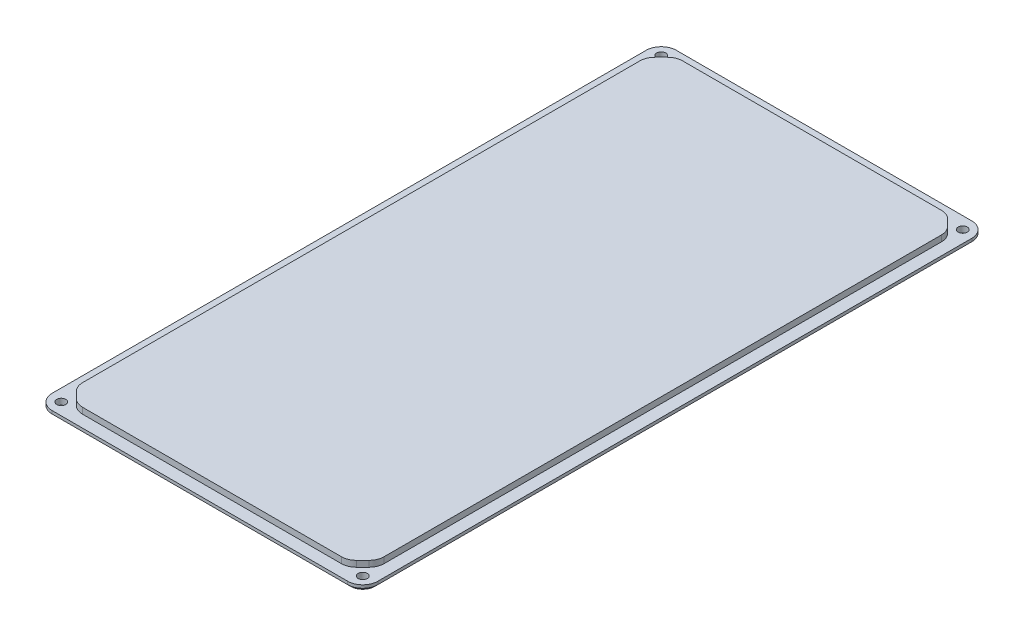
ISO-10303-21;
HEADER;
FILE_DESCRIPTION(('STEP AP214'),'2;1');
FILE_NAME('part.step','',(''),(''),'','','');
FILE_SCHEMA(('AUTOMOTIVE_DESIGN { 1 0 10303 214 1 1 1 1 }'));
ENDSEC;
DATA;
#1=APPLICATION_CONTEXT('core data for automotive mechanical design processes');
#2=APPLICATION_PROTOCOL_DEFINITION('international standard','automotive_design',2000,#1);
#3=PRODUCT_CONTEXT('',#1,'mechanical');
#4=PRODUCT('Part','Part','',(#3));
#5=PRODUCT_RELATED_PRODUCT_CATEGORY('part','',(#4));
#6=PRODUCT_DEFINITION_FORMATION('','',#4);
#7=PRODUCT_DEFINITION_CONTEXT('part definition',#1,'design');
#8=PRODUCT_DEFINITION('design','',#6,#7);
#9=PRODUCT_DEFINITION_SHAPE('','',#8);
#10=(LENGTH_UNIT() NAMED_UNIT(*) SI_UNIT(.MILLI.,.METRE.));
#11=(NAMED_UNIT(*) PLANE_ANGLE_UNIT() SI_UNIT($,.RADIAN.));
#12=(NAMED_UNIT(*) SI_UNIT($,.STERADIAN.) SOLID_ANGLE_UNIT());
#13=UNCERTAINTY_MEASURE_WITH_UNIT(LENGTH_MEASURE(1.E-05),#10,'distance_accuracy_value','');
#14=(GEOMETRIC_REPRESENTATION_CONTEXT(3) GLOBAL_UNCERTAINTY_ASSIGNED_CONTEXT((#13)) GLOBAL_UNIT_ASSIGNED_CONTEXT((#10,
#11,#12)) REPRESENTATION_CONTEXT('',''));
#15=CARTESIAN_POINT('',(0.,0.,0.));
#16=DIRECTION('',(0.,0.,1.));
#17=DIRECTION('',(1.,0.,0.));
#18=AXIS2_PLACEMENT_3D('',#15,#16,#17);
#19=CARTESIAN_POINT('',(0.,2.,0.));
#20=DIRECTION('',(0.,1.,0.));
#21=DIRECTION('',(0.,0.,1.));
#22=AXIS2_PLACEMENT_3D('',#19,#20,#21);
#23=PLANE('',#22);
#24=CARTESIAN_POINT('',(50.,2.,-99.5));
#25=DIRECTION('',(0.,1.,0.));
#26=DIRECTION('',(0.,0.,1.));
#27=AXIS2_PLACEMENT_3D('',#24,#25,#26);
#28=CIRCLE('',#27,1.49999999999999);
#29=CARTESIAN_POINT('',(50.,2.,-98.));
#30=VERTEX_POINT('',#29);
#31=EDGE_CURVE('E397',#30,#30,#28,.T.);
#32=ORIENTED_EDGE('',*,*,#31,.F.);
#33=EDGE_LOOP('',(#32));
#34=FACE_BOUND('',#33,.T.);
#35=CARTESIAN_POINT('',(-50.,2.,-99.5));
#36=DIRECTION('',(0.,1.,0.));
#37=DIRECTION('',(0.,0.,1.));
#38=AXIS2_PLACEMENT_3D('',#35,#36,#37);
#39=CIRCLE('',#38,1.49999999999999);
#40=CARTESIAN_POINT('',(-50.,2.,-98.));
#41=VERTEX_POINT('',#40);
#42=EDGE_CURVE('E407',#41,#41,#39,.T.);
#43=ORIENTED_EDGE('',*,*,#42,.F.);
#44=EDGE_LOOP('',(#43));
#45=FACE_BOUND('',#44,.T.);
#46=CARTESIAN_POINT('',(-50.,2.,99.5));
#47=DIRECTION('',(0.,1.,0.));
#48=DIRECTION('',(0.,0.,1.));
#49=AXIS2_PLACEMENT_3D('',#46,#47,#48);
#50=CIRCLE('',#49,1.49999999999999);
#51=CARTESIAN_POINT('',(-50.,2.,101.));
#52=VERTEX_POINT('',#51);
#53=EDGE_CURVE('E413',#52,#52,#50,.T.);
#54=ORIENTED_EDGE('',*,*,#53,.F.);
#55=EDGE_LOOP('',(#54));
#56=FACE_BOUND('',#55,.T.);
#57=CARTESIAN_POINT('',(50.,2.,99.5));
#58=DIRECTION('',(0.,1.,0.));
#59=DIRECTION('',(0.,0.,1.));
#60=AXIS2_PLACEMENT_3D('',#57,#58,#59);
#61=CIRCLE('',#60,1.49999999999999);
#62=CARTESIAN_POINT('',(50.,2.,101.));
#63=VERTEX_POINT('',#62);
#64=EDGE_CURVE('E419',#63,#63,#61,.T.);
#65=ORIENTED_EDGE('',*,*,#64,.F.);
#66=EDGE_LOOP('',(#65));
#67=FACE_BOUND('',#66,.T.);
#68=DIRECTION('',(0.,0.,1.));
#69=VECTOR('',#68,1.);
#70=CARTESIAN_POINT('',(-54.,2.,-103.5));
#71=LINE('',#70,#69);
#72=CARTESIAN_POINT('',(-54.,2.,-98.5));
#73=VERTEX_POINT('',#72);
#74=CARTESIAN_POINT('',(-54.,2.,98.5));
#75=VERTEX_POINT('',#74);
#76=EDGE_CURVE('E227',#73,#75,#71,.T.);
#77=ORIENTED_EDGE('',*,*,#76,.T.);
#78=CARTESIAN_POINT('',(-49.,2.,98.5));
#79=DIRECTION('',(0.,1.,0.));
#80=DIRECTION('',(0.,0.,1.));
#81=AXIS2_PLACEMENT_3D('',#78,#79,#80);
#82=CIRCLE('',#81,5.);
#83=CARTESIAN_POINT('',(-49.,2.,103.5));
#84=VERTEX_POINT('',#83);
#85=EDGE_CURVE('E221',#75,#84,#82,.T.);
#86=ORIENTED_EDGE('',*,*,#85,.T.);
#87=DIRECTION('',(1.,0.,0.));
#88=VECTOR('',#87,1.);
#89=CARTESIAN_POINT('',(-54.,2.,103.5));
#90=LINE('',#89,#88);
#91=CARTESIAN_POINT('',(49.,2.,103.5));
#92=VERTEX_POINT('',#91);
#93=EDGE_CURVE('E224',#84,#92,#90,.T.);
#94=ORIENTED_EDGE('',*,*,#93,.T.);
#95=CARTESIAN_POINT('',(49.,2.,98.5));
#96=DIRECTION('',(0.,1.,0.));
#97=DIRECTION('',(0.,0.,1.));
#98=AXIS2_PLACEMENT_3D('',#95,#96,#97);
#99=CIRCLE('',#98,5.);
#100=CARTESIAN_POINT('',(54.,2.,98.5));
#101=VERTEX_POINT('',#100);
#102=EDGE_CURVE('E232',#92,#101,#99,.T.);
#103=ORIENTED_EDGE('',*,*,#102,.T.);
#104=DIRECTION('',(0.,0.,-1.));
#105=VECTOR('',#104,1.);
#106=CARTESIAN_POINT('',(54.,2.,-103.5));
#107=LINE('',#106,#105);
#108=CARTESIAN_POINT('',(54.,2.,-98.5));
#109=VERTEX_POINT('',#108);
#110=EDGE_CURVE('E436',#101,#109,#107,.T.);
#111=ORIENTED_EDGE('',*,*,#110,.T.);
#112=CARTESIAN_POINT('',(49.,2.,-98.5));
#113=DIRECTION('',(0.,1.,0.));
#114=DIRECTION('',(0.,0.,1.));
#115=AXIS2_PLACEMENT_3D('',#112,#113,#114);
#116=CIRCLE('',#115,5.);
#117=CARTESIAN_POINT('',(49.,2.,-103.5));
#118=VERTEX_POINT('',#117);
#119=EDGE_CURVE('E259',#109,#118,#116,.T.);
#120=ORIENTED_EDGE('',*,*,#119,.T.);
#121=DIRECTION('',(-1.,0.,0.));
#122=VECTOR('',#121,1.);
#123=CARTESIAN_POINT('',(-54.,2.,-103.5));
#124=LINE('',#123,#122);
#125=CARTESIAN_POINT('',(-49.,2.,-103.5));
#126=VERTEX_POINT('',#125);
#127=EDGE_CURVE('E449',#118,#126,#124,.T.);
#128=ORIENTED_EDGE('',*,*,#127,.T.);
#129=CARTESIAN_POINT('',(-49.,2.,-98.5));
#130=DIRECTION('',(0.,1.,0.));
#131=DIRECTION('',(0.,0.,1.));
#132=AXIS2_PLACEMENT_3D('',#129,#130,#131);
#133=CIRCLE('',#132,5.);
#134=EDGE_CURVE('E257',#126,#73,#133,.T.);
#135=ORIENTED_EDGE('',*,*,#134,.T.);
#136=EDGE_LOOP('',(#77,#86,#94,#103,#111,#120,#128,#135));
#137=FACE_BOUND('',#136,.T.);
#138=DIRECTION('',(-1.,0.,0.));
#139=VECTOR('',#138,1.);
#140=CARTESIAN_POINT('',(-50.,2.,-99.5));
#141=LINE('',#140,#139);
#142=CARTESIAN_POINT('',(42.9289321881345,2.,-99.5));
#143=VERTEX_POINT('',#142);
#144=CARTESIAN_POINT('',(-42.9289321881345,2.,-99.5));
#145=VERTEX_POINT('',#144);
#146=EDGE_CURVE('E439',#143,#145,#141,.T.);
#147=ORIENTED_EDGE('',*,*,#146,.F.);
#148=CARTESIAN_POINT('',(42.9289321881345,2.,-94.5));
#149=DIRECTION('',(0.,1.,0.));
#150=DIRECTION('',(0.,0.,1.));
#151=AXIS2_PLACEMENT_3D('',#148,#149,#150);
#152=CIRCLE('',#151,5.);
#153=CARTESIAN_POINT('',(46.4644660940673,2.,-98.0355339059327));
#154=VERTEX_POINT('',#153);
#155=EDGE_CURVE('E334',#143,#154,#152,.F.);
#156=ORIENTED_EDGE('',*,*,#155,.T.);
#157=DIRECTION('',(-0.707106781186546,0.,-0.707106781186549));
#158=VECTOR('',#157,1.);
#159=CARTESIAN_POINT('',(45.,2.,-99.5));
#160=LINE('',#159,#158);
#161=CARTESIAN_POINT('',(48.5355339059327,2.,-95.9644660940672));
#162=VERTEX_POINT('',#161);
#163=EDGE_CURVE('E467',#154,#162,#160,.F.);
#164=ORIENTED_EDGE('',*,*,#163,.T.);
#165=CARTESIAN_POINT('',(45.,2.,-92.4289321881345));
#166=DIRECTION('',(0.,1.,0.));
#167=DIRECTION('',(0.,0.,1.));
#168=AXIS2_PLACEMENT_3D('',#165,#166,#167);
#169=CIRCLE('',#168,5.);
#170=CARTESIAN_POINT('',(50.,2.,-92.4289321881345));
#171=VERTEX_POINT('',#170);
#172=EDGE_CURVE('E336',#162,#171,#169,.F.);
#173=ORIENTED_EDGE('',*,*,#172,.T.);
#174=DIRECTION('',(0.,0.,-1.));
#175=VECTOR('',#174,1.);
#176=CARTESIAN_POINT('',(50.,2.,-99.5));
#177=LINE('',#176,#175);
#178=CARTESIAN_POINT('',(50.,2.,92.4289321881346));
#179=VERTEX_POINT('',#178);
#180=EDGE_CURVE('E422',#179,#171,#177,.T.);
#181=ORIENTED_EDGE('',*,*,#180,.F.);
#182=CARTESIAN_POINT('',(45.,2.,92.4289321881346));
#183=DIRECTION('',(0.,1.,0.));
#184=DIRECTION('',(0.,0.,1.));
#185=AXIS2_PLACEMENT_3D('',#182,#183,#184);
#186=CIRCLE('',#185,5.);
#187=CARTESIAN_POINT('',(48.5355339059327,2.,95.9644660940673));
#188=VERTEX_POINT('',#187);
#189=EDGE_CURVE('E330',#179,#188,#186,.F.);
#190=ORIENTED_EDGE('',*,*,#189,.T.);
#191=DIRECTION('',(0.70710678118655,0.,-0.707106781186545));
#192=VECTOR('',#191,1.);
#193=CARTESIAN_POINT('',(50.,2.,94.5));
#194=LINE('',#193,#192);
#195=CARTESIAN_POINT('',(46.4644660940673,2.,98.0355339059328));
#196=VERTEX_POINT('',#195);
#197=EDGE_CURVE('E252',#188,#196,#194,.F.);
#198=ORIENTED_EDGE('',*,*,#197,.T.);
#199=CARTESIAN_POINT('',(42.9289321881345,2.,94.5));
#200=DIRECTION('',(0.,1.,0.));
#201=DIRECTION('',(0.,0.,1.));
#202=AXIS2_PLACEMENT_3D('',#199,#200,#201);
#203=CIRCLE('',#202,5.);
#204=CARTESIAN_POINT('',(42.9289321881345,2.,99.5));
#205=VERTEX_POINT('',#204);
#206=EDGE_CURVE('E332',#196,#205,#203,.F.);
#207=ORIENTED_EDGE('',*,*,#206,.T.);
#208=DIRECTION('',(1.,0.,0.));
#209=VECTOR('',#208,1.);
#210=CARTESIAN_POINT('',(-50.,2.,99.5));
#211=LINE('',#210,#209);
#212=CARTESIAN_POINT('',(-42.9289321881345,2.,99.5));
#213=VERTEX_POINT('',#212);
#214=EDGE_CURVE('E427',#213,#205,#211,.T.);
#215=ORIENTED_EDGE('',*,*,#214,.F.);
#216=CARTESIAN_POINT('',(-42.9289321881345,2.,94.5));
#217=DIRECTION('',(0.,1.,0.));
#218=DIRECTION('',(0.,0.,1.));
#219=AXIS2_PLACEMENT_3D('',#216,#217,#218);
#220=CIRCLE('',#219,5.);
#221=CARTESIAN_POINT('',(-46.4644660940673,2.,98.0355339059327));
#222=VERTEX_POINT('',#221);
#223=EDGE_CURVE('E328',#213,#222,#220,.F.);
#224=ORIENTED_EDGE('',*,*,#223,.T.);
#225=DIRECTION('',(0.707106781186546,0.,0.707106781186549));
#226=VECTOR('',#225,1.);
#227=CARTESIAN_POINT('',(-45.,2.,99.5));
#228=LINE('',#227,#226);
#229=CARTESIAN_POINT('',(-48.5355339059327,2.,95.9644660940673));
#230=VERTEX_POINT('',#229);
#231=EDGE_CURVE('E470',#222,#230,#228,.F.);
#232=ORIENTED_EDGE('',*,*,#231,.T.);
#233=CARTESIAN_POINT('',(-45.,2.,92.4289321881345));
#234=DIRECTION('',(0.,1.,0.));
#235=DIRECTION('',(0.,0.,1.));
#236=AXIS2_PLACEMENT_3D('',#233,#234,#235);
#237=CIRCLE('',#236,5.);
#238=CARTESIAN_POINT('',(-50.,2.,92.4289321881345));
#239=VERTEX_POINT('',#238);
#240=EDGE_CURVE('E326',#230,#239,#237,.F.);
#241=ORIENTED_EDGE('',*,*,#240,.T.);
#242=DIRECTION('',(0.,0.,1.));
#243=VECTOR('',#242,1.);
#244=CARTESIAN_POINT('',(-50.,2.,-99.5));
#245=LINE('',#244,#243);
#246=CARTESIAN_POINT('',(-50.,2.,-92.4289321881345));
#247=VERTEX_POINT('',#246);
#248=EDGE_CURVE('E442',#247,#239,#245,.T.);
#249=ORIENTED_EDGE('',*,*,#248,.F.);
#250=CARTESIAN_POINT('',(-45.,2.,-92.4289321881345));
#251=DIRECTION('',(0.,1.,0.));
#252=DIRECTION('',(0.,0.,1.));
#253=AXIS2_PLACEMENT_3D('',#250,#251,#252);
#254=CIRCLE('',#253,5.);
#255=CARTESIAN_POINT('',(-48.5355339059327,2.,-95.9644660940673));
#256=VERTEX_POINT('',#255);
#257=EDGE_CURVE('E340',#247,#256,#254,.F.);
#258=ORIENTED_EDGE('',*,*,#257,.T.);
#259=DIRECTION('',(-0.707106781186549,0.,0.707106781186546));
#260=VECTOR('',#259,1.);
#261=CARTESIAN_POINT('',(-50.,2.,-94.5));
#262=LINE('',#261,#260);
#263=CARTESIAN_POINT('',(-46.4644660940673,2.,-98.0355339059327));
#264=VERTEX_POINT('',#263);
#265=EDGE_CURVE('E464',#256,#264,#262,.F.);
#266=ORIENTED_EDGE('',*,*,#265,.T.);
#267=CARTESIAN_POINT('',(-42.9289321881345,2.,-94.5));
#268=DIRECTION('',(0.,1.,0.));
#269=DIRECTION('',(0.,0.,1.));
#270=AXIS2_PLACEMENT_3D('',#267,#268,#269);
#271=CIRCLE('',#270,5.);
#272=EDGE_CURVE('E338',#264,#145,#271,.F.);
#273=ORIENTED_EDGE('',*,*,#272,.T.);
#274=EDGE_LOOP('',(#147,#156,#164,#173,#181,#190,#198,#207,#215,#224,#232,#241,#249,#258,#266,#273));
#275=FACE_BOUND('',#274,.T.);
#276=ADVANCED_FACE('F33',(#34,#45,#56,#67,#137,#275),#23,.T.);
#277=CARTESIAN_POINT('',(54.,2.,-103.5));
#278=DIRECTION('',(-1.,0.,0.));
#279=DIRECTION('',(0.,0.,1.));
#280=AXIS2_PLACEMENT_3D('',#277,#278,#279);
#281=PLANE('',#280);
#282=DIRECTION('',(0.,-1.,0.));
#283=VECTOR('',#282,1.);
#284=CARTESIAN_POINT('',(54.,2.,98.5));
#285=LINE('',#284,#283);
#286=CARTESIAN_POINT('',(54.,0.999999999999973,98.5));
#287=VERTEX_POINT('',#286);
#288=EDGE_CURVE('E295',#101,#287,#285,.T.);
#289=ORIENTED_EDGE('',*,*,#288,.T.);
#290=DIRECTION('',(0.,0.,-1.));
#291=VECTOR('',#290,1.);
#292=CARTESIAN_POINT('',(54.,0.999999999999973,-103.5));
#293=LINE('',#292,#291);
#294=CARTESIAN_POINT('',(54.,0.999999999999973,-98.5));
#295=VERTEX_POINT('',#294);
#296=EDGE_CURVE('E364',#287,#295,#293,.T.);
#297=ORIENTED_EDGE('',*,*,#296,.T.);
#298=DIRECTION('',(0.,-1.,0.));
#299=VECTOR('',#298,1.);
#300=CARTESIAN_POINT('',(54.,2.,-98.5));
#301=LINE('',#300,#299);
#302=EDGE_CURVE('E293',#295,#109,#301,.F.);
#303=ORIENTED_EDGE('',*,*,#302,.T.);
#304=ORIENTED_EDGE('',*,*,#110,.F.);
#305=EDGE_LOOP('',(#289,#297,#303,#304));
#306=FACE_BOUND('',#305,.T.);
#307=ADVANCED_FACE('F556',(#306),#281,.F.);
#308=CARTESIAN_POINT('',(-54.,2.,-103.5));
#309=DIRECTION('',(0.,0.,1.));
#310=DIRECTION('',(1.,0.,0.));
#311=AXIS2_PLACEMENT_3D('',#308,#309,#310);
#312=PLANE('',#311);
#313=DIRECTION('',(0.,-1.,0.));
#314=VECTOR('',#313,1.);
#315=CARTESIAN_POINT('',(49.,2.,-103.5));
#316=LINE('',#315,#314);
#317=CARTESIAN_POINT('',(49.,0.999999999999973,-103.5));
#318=VERTEX_POINT('',#317);
#319=EDGE_CURVE('E310',#118,#318,#316,.T.);
#320=ORIENTED_EDGE('',*,*,#319,.T.);
#321=DIRECTION('',(-1.,0.,0.));
#322=VECTOR('',#321,1.);
#323=CARTESIAN_POINT('',(-54.,0.999999999999973,-103.5));
#324=LINE('',#323,#322);
#325=CARTESIAN_POINT('',(-49.,0.999999999999973,-103.5));
#326=VERTEX_POINT('',#325);
#327=EDGE_CURVE('E11',#318,#326,#324,.T.);
#328=ORIENTED_EDGE('',*,*,#327,.T.);
#329=DIRECTION('',(0.,-1.,0.));
#330=VECTOR('',#329,1.);
#331=CARTESIAN_POINT('',(-49.,2.,-103.5));
#332=LINE('',#331,#330);
#333=EDGE_CURVE('E308',#326,#126,#332,.F.);
#334=ORIENTED_EDGE('',*,*,#333,.T.);
#335=ORIENTED_EDGE('',*,*,#127,.F.);
#336=EDGE_LOOP('',(#320,#328,#334,#335));
#337=FACE_BOUND('',#336,.T.);
#338=ADVANCED_FACE('F562',(#337),#312,.F.);
#339=CARTESIAN_POINT('',(-54.,2.,-103.5));
#340=DIRECTION('',(1.,0.,0.));
#341=DIRECTION('',(0.,0.,-1.));
#342=AXIS2_PLACEMENT_3D('',#339,#340,#341);
#343=PLANE('',#342);
#344=DIRECTION('',(0.,-1.,0.));
#345=VECTOR('',#344,1.);
#346=CARTESIAN_POINT('',(-54.,2.,-98.5));
#347=LINE('',#346,#345);
#348=CARTESIAN_POINT('',(-54.,0.999999999999973,-98.5));
#349=VERTEX_POINT('',#348);
#350=EDGE_CURVE('E247',#73,#349,#347,.T.);
#351=ORIENTED_EDGE('',*,*,#350,.T.);
#352=DIRECTION('',(0.,0.,1.));
#353=VECTOR('',#352,1.);
#354=CARTESIAN_POINT('',(-54.,0.999999999999973,-103.5));
#355=LINE('',#354,#353);
#356=CARTESIAN_POINT('',(-54.,0.999999999999973,98.5));
#357=VERTEX_POINT('',#356);
#358=EDGE_CURVE('E366',#349,#357,#355,.T.);
#359=ORIENTED_EDGE('',*,*,#358,.T.);
#360=DIRECTION('',(0.,-1.,0.));
#361=VECTOR('',#360,1.);
#362=CARTESIAN_POINT('',(-54.,2.,98.5));
#363=LINE('',#362,#361);
#364=EDGE_CURVE('E250',#357,#75,#363,.F.);
#365=ORIENTED_EDGE('',*,*,#364,.T.);
#366=ORIENTED_EDGE('',*,*,#76,.F.);
#367=EDGE_LOOP('',(#351,#359,#365,#366));
#368=FACE_BOUND('',#367,.T.);
#369=ADVANCED_FACE('F576',(#368),#343,.F.);
#370=CARTESIAN_POINT('',(-54.,2.,103.5));
#371=DIRECTION('',(0.,0.,-1.));
#372=DIRECTION('',(-1.,0.,0.));
#373=AXIS2_PLACEMENT_3D('',#370,#371,#372);
#374=PLANE('',#373);
#375=DIRECTION('',(0.,-1.,0.));
#376=VECTOR('',#375,1.);
#377=CARTESIAN_POINT('',(-49.,2.,103.5));
#378=LINE('',#377,#376);
#379=CARTESIAN_POINT('',(-49.,0.999999999999973,103.5));
#380=VERTEX_POINT('',#379);
#381=EDGE_CURVE('E238',#84,#380,#378,.T.);
#382=ORIENTED_EDGE('',*,*,#381,.T.);
#383=DIRECTION('',(1.,0.,0.));
#384=VECTOR('',#383,1.);
#385=CARTESIAN_POINT('',(-54.,0.999999999999973,103.5));
#386=LINE('',#385,#384);
#387=CARTESIAN_POINT('',(49.,0.999999999999973,103.5));
#388=VERTEX_POINT('',#387);
#389=EDGE_CURVE('E342',#380,#388,#386,.T.);
#390=ORIENTED_EDGE('',*,*,#389,.T.);
#391=DIRECTION('',(0.,-1.,0.));
#392=VECTOR('',#391,1.);
#393=CARTESIAN_POINT('',(49.,2.,103.5));
#394=LINE('',#393,#392);
#395=EDGE_CURVE('E241',#388,#92,#394,.F.);
#396=ORIENTED_EDGE('',*,*,#395,.T.);
#397=ORIENTED_EDGE('',*,*,#93,.F.);
#398=EDGE_LOOP('',(#382,#390,#396,#397));
#399=FACE_BOUND('',#398,.T.);
#400=ADVANCED_FACE('F236',(#399),#374,.F.);
#401=CARTESIAN_POINT('',(0.,0.,0.));
#402=DIRECTION('',(0.,1.,0.));
#403=DIRECTION('',(0.,0.,1.));
#404=AXIS2_PLACEMENT_3D('',#401,#402,#403);
#405=PLANE('',#404);
#406=CARTESIAN_POINT('',(49.,0.,98.5));
#407=DIRECTION('',(0.,1.,0.));
#408=DIRECTION('',(0.,0.,1.));
#409=AXIS2_PLACEMENT_3D('',#406,#407,#408);
#410=CIRCLE('',#409,4.00000000000003);
#411=CARTESIAN_POINT('',(53.,0.,98.5));
#412=VERTEX_POINT('',#411);
#413=CARTESIAN_POINT('',(49.,0.,102.5));
#414=VERTEX_POINT('',#413);
#415=EDGE_CURVE('E356',#412,#414,#410,.F.);
#416=ORIENTED_EDGE('',*,*,#415,.T.);
#417=DIRECTION('',(-1.,0.,0.));
#418=VECTOR('',#417,1.);
#419=CARTESIAN_POINT('',(0.,0.,102.5));
#420=LINE('',#419,#418);
#421=CARTESIAN_POINT('',(-49.,0.,102.5));
#422=VERTEX_POINT('',#421);
#423=EDGE_CURVE('E358',#414,#422,#420,.T.);
#424=ORIENTED_EDGE('',*,*,#423,.T.);
#425=CARTESIAN_POINT('',(-49.,0.,98.5));
#426=DIRECTION('',(0.,1.,0.));
#427=DIRECTION('',(0.,0.,1.));
#428=AXIS2_PLACEMENT_3D('',#425,#426,#427);
#429=CIRCLE('',#428,4.00000000000002);
#430=CARTESIAN_POINT('',(-53.,0.,98.5));
#431=VERTEX_POINT('',#430);
#432=EDGE_CURVE('E354',#422,#431,#429,.F.);
#433=ORIENTED_EDGE('',*,*,#432,.T.);
#434=DIRECTION('',(0.,0.,-1.));
#435=VECTOR('',#434,1.);
#436=CARTESIAN_POINT('',(-53.,0.,0.));
#437=LINE('',#436,#435);
#438=CARTESIAN_POINT('',(-53.,0.,-98.5));
#439=VERTEX_POINT('',#438);
#440=EDGE_CURVE('E350',#431,#439,#437,.T.);
#441=ORIENTED_EDGE('',*,*,#440,.T.);
#442=CARTESIAN_POINT('',(-49.,0.,-98.5));
#443=DIRECTION('',(0.,1.,0.));
#444=DIRECTION('',(0.,0.,1.));
#445=AXIS2_PLACEMENT_3D('',#442,#443,#444);
#446=CIRCLE('',#445,4.00000000000003);
#447=CARTESIAN_POINT('',(-49.,0.,-102.5));
#448=VERTEX_POINT('',#447);
#449=EDGE_CURVE('E346',#439,#448,#446,.F.);
#450=ORIENTED_EDGE('',*,*,#449,.T.);
#451=DIRECTION('',(1.,0.,0.));
#452=VECTOR('',#451,1.);
#453=CARTESIAN_POINT('',(0.,0.,-102.5));
#454=LINE('',#453,#452);
#455=CARTESIAN_POINT('',(49.,0.,-102.5));
#456=VERTEX_POINT('',#455);
#457=EDGE_CURVE('E344',#448,#456,#454,.T.);
#458=ORIENTED_EDGE('',*,*,#457,.T.);
#459=CARTESIAN_POINT('',(49.,0.,-98.5));
#460=DIRECTION('',(0.,1.,0.));
#461=DIRECTION('',(0.,0.,1.));
#462=AXIS2_PLACEMENT_3D('',#459,#460,#461);
#463=CIRCLE('',#462,4.00000000000002);
#464=CARTESIAN_POINT('',(53.,0.,-98.5));
#465=VERTEX_POINT('',#464);
#466=EDGE_CURVE('E348',#456,#465,#463,.F.);
#467=ORIENTED_EDGE('',*,*,#466,.T.);
#468=DIRECTION('',(0.,0.,1.));
#469=VECTOR('',#468,1.);
#470=CARTESIAN_POINT('',(53.,0.,0.));
#471=LINE('',#470,#469);
#472=EDGE_CURVE('E352',#465,#412,#471,.T.);
#473=ORIENTED_EDGE('',*,*,#472,.T.);
#474=EDGE_LOOP('',(#416,#424,#433,#441,#450,#458,#467,#473));
#475=FACE_BOUND('',#474,.T.);
#476=CARTESIAN_POINT('',(50.,0.,-99.5));
#477=DIRECTION('',(0.,-1.,0.));
#478=DIRECTION('',(0.,0.,-1.));
#479=AXIS2_PLACEMENT_3D('',#476,#477,#478);
#480=CIRCLE('',#479,1.49999999999999);
#481=CARTESIAN_POINT('',(50.,0.,-101.));
#482=VERTEX_POINT('',#481);
#483=EDGE_CURVE('E391',#482,#482,#480,.T.);
#484=ORIENTED_EDGE('',*,*,#483,.F.);
#485=EDGE_LOOP('',(#484));
#486=FACE_BOUND('',#485,.T.);
#487=CARTESIAN_POINT('',(-50.,0.,-99.5));
#488=DIRECTION('',(0.,-1.,0.));
#489=DIRECTION('',(0.,0.,-1.));
#490=AXIS2_PLACEMENT_3D('',#487,#488,#489);
#491=CIRCLE('',#490,1.49999999999999);
#492=CARTESIAN_POINT('',(-50.,0.,-101.));
#493=VERTEX_POINT('',#492);
#494=EDGE_CURVE('E402',#493,#493,#491,.T.);
#495=ORIENTED_EDGE('',*,*,#494,.F.);
#496=EDGE_LOOP('',(#495));
#497=FACE_BOUND('',#496,.T.);
#498=CARTESIAN_POINT('',(-50.,0.,99.5));
#499=DIRECTION('',(0.,-1.,0.));
#500=DIRECTION('',(0.,0.,-1.));
#501=AXIS2_PLACEMENT_3D('',#498,#499,#500);
#502=CIRCLE('',#501,1.49999999999999);
#503=CARTESIAN_POINT('',(-50.,0.,98.));
#504=VERTEX_POINT('',#503);
#505=EDGE_CURVE('E410',#504,#504,#502,.T.);
#506=ORIENTED_EDGE('',*,*,#505,.F.);
#507=EDGE_LOOP('',(#506));
#508=FACE_BOUND('',#507,.T.);
#509=CARTESIAN_POINT('',(50.,0.,99.5));
#510=DIRECTION('',(0.,-1.,0.));
#511=DIRECTION('',(0.,0.,-1.));
#512=AXIS2_PLACEMENT_3D('',#509,#510,#511);
#513=CIRCLE('',#512,1.49999999999999);
#514=CARTESIAN_POINT('',(50.,0.,98.));
#515=VERTEX_POINT('',#514);
#516=EDGE_CURVE('E416',#515,#515,#513,.T.);
#517=ORIENTED_EDGE('',*,*,#516,.F.);
#518=EDGE_LOOP('',(#517));
#519=FACE_BOUND('',#518,.T.);
#520=ADVANCED_FACE('F570',(#475,#486,#497,#508,#519),#405,.F.);
#521=CARTESIAN_POINT('',(50.,4.,-99.5));
#522=DIRECTION('',(-1.,0.,0.));
#523=DIRECTION('',(0.,0.,1.));
#524=AXIS2_PLACEMENT_3D('',#521,#522,#523);
#525=PLANE('',#524);
#526=DIRECTION('',(0.,0.,-1.));
#527=VECTOR('',#526,1.);
#528=CARTESIAN_POINT('',(50.,4.,-99.5));
#529=LINE('',#528,#527);
#530=CARTESIAN_POINT('',(50.,4.,92.4289321881346));
#531=VERTEX_POINT('',#530);
#532=CARTESIAN_POINT('',(50.,4.,-92.4289321881345));
#533=VERTEX_POINT('',#532);
#534=EDGE_CURVE('E423',#531,#533,#529,.T.);
#535=ORIENTED_EDGE('',*,*,#534,.F.);
#536=DIRECTION('',(0.,1.,0.));
#537=VECTOR('',#536,1.);
#538=CARTESIAN_POINT('',(50.,2.,92.4289321881346));
#539=LINE('',#538,#537);
#540=EDGE_CURVE('E301',#531,#179,#539,.F.);
#541=ORIENTED_EDGE('',*,*,#540,.T.);
#542=ORIENTED_EDGE('',*,*,#180,.T.);
#543=DIRECTION('',(0.,-1.,0.));
#544=VECTOR('',#543,1.);
#545=CARTESIAN_POINT('',(50.,4.,-92.4289321881345));
#546=LINE('',#545,#544);
#547=EDGE_CURVE('E298',#171,#533,#546,.F.);
#548=ORIENTED_EDGE('',*,*,#547,.T.);
#549=EDGE_LOOP('',(#535,#541,#542,#548));
#550=FACE_BOUND('',#549,.T.);
#551=ADVANCED_FACE('F541',(#550),#525,.F.);
#552=CARTESIAN_POINT('',(-50.,4.,-99.5));
#553=DIRECTION('',(0.,0.,1.));
#554=DIRECTION('',(1.,0.,0.));
#555=AXIS2_PLACEMENT_3D('',#552,#553,#554);
#556=PLANE('',#555);
#557=DIRECTION('',(-1.,0.,0.));
#558=VECTOR('',#557,1.);
#559=CARTESIAN_POINT('',(-50.,4.,-99.5));
#560=LINE('',#559,#558);
#561=CARTESIAN_POINT('',(42.9289321881345,4.,-99.5));
#562=VERTEX_POINT('',#561);
#563=CARTESIAN_POINT('',(-42.9289321881345,4.,-99.5));
#564=VERTEX_POINT('',#563);
#565=EDGE_CURVE('E426',#562,#564,#560,.T.);
#566=ORIENTED_EDGE('',*,*,#565,.F.);
#567=DIRECTION('',(0.,1.,0.));
#568=VECTOR('',#567,1.);
#569=CARTESIAN_POINT('',(42.9289321881345,2.,-99.5));
#570=LINE('',#569,#568);
#571=EDGE_CURVE('E315',#562,#143,#570,.F.);
#572=ORIENTED_EDGE('',*,*,#571,.T.);
#573=ORIENTED_EDGE('',*,*,#146,.T.);
#574=DIRECTION('',(0.,-1.,0.));
#575=VECTOR('',#574,1.);
#576=CARTESIAN_POINT('',(-42.9289321881345,4.,-99.5));
#577=LINE('',#576,#575);
#578=EDGE_CURVE('E312',#145,#564,#577,.F.);
#579=ORIENTED_EDGE('',*,*,#578,.T.);
#580=EDGE_LOOP('',(#566,#572,#573,#579));
#581=FACE_BOUND('',#580,.T.);
#582=ADVANCED_FACE('F524',(#581),#556,.F.);
#583=CARTESIAN_POINT('',(-50.,4.,-99.5));
#584=DIRECTION('',(1.,0.,0.));
#585=DIRECTION('',(0.,0.,-1.));
#586=AXIS2_PLACEMENT_3D('',#583,#584,#585);
#587=PLANE('',#586);
#588=ORIENTED_EDGE('',*,*,#248,.T.);
#589=DIRECTION('',(0.,-1.,0.));
#590=VECTOR('',#589,1.);
#591=CARTESIAN_POINT('',(-50.,4.,92.4289321881345));
#592=LINE('',#591,#590);
#593=CARTESIAN_POINT('',(-50.,4.,92.4289321881345));
#594=VERTEX_POINT('',#593);
#595=EDGE_CURVE('E264',#239,#594,#592,.F.);
#596=ORIENTED_EDGE('',*,*,#595,.T.);
#597=DIRECTION('',(0.,0.,1.));
#598=VECTOR('',#597,1.);
#599=CARTESIAN_POINT('',(-50.,4.,-99.5));
#600=LINE('',#599,#598);
#601=CARTESIAN_POINT('',(-50.,4.,-92.4289321881345));
#602=VERTEX_POINT('',#601);
#603=EDGE_CURVE('E430',#602,#594,#600,.T.);
#604=ORIENTED_EDGE('',*,*,#603,.F.);
#605=DIRECTION('',(0.,1.,0.));
#606=VECTOR('',#605,1.);
#607=CARTESIAN_POINT('',(-50.,2.,-92.4289321881345));
#608=LINE('',#607,#606);
#609=EDGE_CURVE('E231',#602,#247,#608,.F.);
#610=ORIENTED_EDGE('',*,*,#609,.T.);
#611=EDGE_LOOP('',(#588,#596,#604,#610));
#612=FACE_BOUND('',#611,.T.);
#613=ADVANCED_FACE('F506',(#612),#587,.F.);
#614=CARTESIAN_POINT('',(-50.,4.,99.5));
#615=DIRECTION('',(0.,0.,-1.));
#616=DIRECTION('',(-1.,0.,0.));
#617=AXIS2_PLACEMENT_3D('',#614,#615,#616);
#618=PLANE('',#617);
#619=DIRECTION('',(1.,0.,0.));
#620=VECTOR('',#619,1.);
#621=CARTESIAN_POINT('',(-50.,4.,99.5));
#622=LINE('',#621,#620);
#623=CARTESIAN_POINT('',(-42.9289321881345,4.,99.5));
#624=VERTEX_POINT('',#623);
#625=CARTESIAN_POINT('',(42.9289321881345,4.,99.5));
#626=VERTEX_POINT('',#625);
#627=EDGE_CURVE('E433',#624,#626,#622,.T.);
#628=ORIENTED_EDGE('',*,*,#627,.F.);
#629=DIRECTION('',(0.,1.,0.));
#630=VECTOR('',#629,1.);
#631=CARTESIAN_POINT('',(-42.9289321881345,2.,99.5));
#632=LINE('',#631,#630);
#633=EDGE_CURVE('E290',#624,#213,#632,.F.);
#634=ORIENTED_EDGE('',*,*,#633,.T.);
#635=ORIENTED_EDGE('',*,*,#214,.T.);
#636=DIRECTION('',(0.,-1.,0.));
#637=VECTOR('',#636,1.);
#638=CARTESIAN_POINT('',(42.9289321881345,4.,99.5));
#639=LINE('',#638,#637);
#640=EDGE_CURVE('E287',#205,#626,#639,.F.);
#641=ORIENTED_EDGE('',*,*,#640,.T.);
#642=EDGE_LOOP('',(#628,#634,#635,#641));
#643=FACE_BOUND('',#642,.T.);
#644=ADVANCED_FACE('F486',(#643),#618,.F.);
#645=CARTESIAN_POINT('',(0.,4.,0.));
#646=DIRECTION('',(0.,1.,0.));
#647=DIRECTION('',(0.,0.,1.));
#648=AXIS2_PLACEMENT_3D('',#645,#646,#647);
#649=PLANE('',#648);
#650=ORIENTED_EDGE('',*,*,#603,.T.);
#651=CARTESIAN_POINT('',(-45.,4.,92.4289321881345));
#652=DIRECTION('',(0.,1.,0.));
#653=DIRECTION('',(0.,0.,1.));
#654=AXIS2_PLACEMENT_3D('',#651,#652,#653);
#655=CIRCLE('',#654,5.);
#656=CARTESIAN_POINT('',(-48.5355339059327,4.,95.9644660940673));
#657=VERTEX_POINT('',#656);
#658=EDGE_CURVE('E281',#594,#657,#655,.T.);
#659=ORIENTED_EDGE('',*,*,#658,.T.);
#660=DIRECTION('',(-0.707106781186546,0.,-0.707106781186549));
#661=VECTOR('',#660,1.);
#662=CARTESIAN_POINT('',(-72.2500000000001,4.,72.2499999999997));
#663=LINE('',#662,#661);
#664=CARTESIAN_POINT('',(-46.4644660940673,4.,98.0355339059327));
#665=VERTEX_POINT('',#664);
#666=EDGE_CURVE('E455',#657,#665,#663,.F.);
#667=ORIENTED_EDGE('',*,*,#666,.T.);
#668=CARTESIAN_POINT('',(-42.9289321881345,4.,94.5));
#669=DIRECTION('',(0.,1.,0.));
#670=DIRECTION('',(0.,0.,1.));
#671=AXIS2_PLACEMENT_3D('',#668,#669,#670);
#672=CIRCLE('',#671,5.);
#673=EDGE_CURVE('E279',#665,#624,#672,.T.);
#674=ORIENTED_EDGE('',*,*,#673,.T.);
#675=ORIENTED_EDGE('',*,*,#627,.T.);
#676=CARTESIAN_POINT('',(42.9289321881345,4.,94.5));
#677=DIRECTION('',(0.,1.,0.));
#678=DIRECTION('',(0.,0.,1.));
#679=AXIS2_PLACEMENT_3D('',#676,#677,#678);
#680=CIRCLE('',#679,5.);
#681=CARTESIAN_POINT('',(46.4644660940672,4.,98.0355339059328));
#682=VERTEX_POINT('',#681);
#683=EDGE_CURVE('E275',#626,#682,#680,.T.);
#684=ORIENTED_EDGE('',*,*,#683,.T.);
#685=DIRECTION('',(-0.70710678118655,0.,0.707106781186545));
#686=VECTOR('',#685,1.);
#687=CARTESIAN_POINT('',(72.2499999999998,4.,72.2500000000003));
#688=LINE('',#687,#686);
#689=CARTESIAN_POINT('',(48.5355339059327,4.,95.9644660940673));
#690=VERTEX_POINT('',#689);
#691=EDGE_CURVE('E242',#682,#690,#688,.F.);
#692=ORIENTED_EDGE('',*,*,#691,.T.);
#693=CARTESIAN_POINT('',(45.,4.,92.4289321881346));
#694=DIRECTION('',(0.,1.,0.));
#695=DIRECTION('',(0.,0.,1.));
#696=AXIS2_PLACEMENT_3D('',#693,#694,#695);
#697=CIRCLE('',#696,5.);
#698=EDGE_CURVE('E277',#690,#531,#697,.T.);
#699=ORIENTED_EDGE('',*,*,#698,.T.);
#700=ORIENTED_EDGE('',*,*,#534,.T.);
#701=CARTESIAN_POINT('',(45.,4.,-92.4289321881345));
#702=DIRECTION('',(0.,1.,0.));
#703=DIRECTION('',(0.,0.,1.));
#704=AXIS2_PLACEMENT_3D('',#701,#702,#703);
#705=CIRCLE('',#704,5.);
#706=CARTESIAN_POINT('',(48.5355339059327,4.,-95.9644660940672));
#707=VERTEX_POINT('',#706);
#708=EDGE_CURVE('E271',#533,#707,#705,.T.);
#709=ORIENTED_EDGE('',*,*,#708,.T.);
#710=DIRECTION('',(0.707106781186546,0.,0.707106781186549));
#711=VECTOR('',#710,1.);
#712=CARTESIAN_POINT('',(72.2500000000001,4.,-72.2499999999997));
#713=LINE('',#712,#711);
#714=CARTESIAN_POINT('',(46.4644660940673,4.,-98.0355339059327));
#715=VERTEX_POINT('',#714);
#716=EDGE_CURVE('E458',#707,#715,#713,.F.);
#717=ORIENTED_EDGE('',*,*,#716,.T.);
#718=CARTESIAN_POINT('',(42.9289321881345,4.,-94.5));
#719=DIRECTION('',(0.,1.,0.));
#720=DIRECTION('',(0.,0.,1.));
#721=AXIS2_PLACEMENT_3D('',#718,#719,#720);
#722=CIRCLE('',#721,5.);
#723=EDGE_CURVE('E273',#715,#562,#722,.T.);
#724=ORIENTED_EDGE('',*,*,#723,.T.);
#725=ORIENTED_EDGE('',*,*,#565,.T.);
#726=CARTESIAN_POINT('',(-42.9289321881345,4.,-94.5));
#727=DIRECTION('',(0.,1.,0.));
#728=DIRECTION('',(0.,0.,1.));
#729=AXIS2_PLACEMENT_3D('',#726,#727,#728);
#730=CIRCLE('',#729,5.);
#731=CARTESIAN_POINT('',(-46.4644660940673,4.,-98.0355339059327));
#732=VERTEX_POINT('',#731);
#733=EDGE_CURVE('E269',#564,#732,#730,.T.);
#734=ORIENTED_EDGE('',*,*,#733,.T.);
#735=DIRECTION('',(0.707106781186549,0.,-0.707106781186546));
#736=VECTOR('',#735,1.);
#737=CARTESIAN_POINT('',(-72.2499999999999,4.,-72.2500000000003));
#738=LINE('',#737,#736);
#739=CARTESIAN_POINT('',(-48.5355339059327,4.,-95.9644660940673));
#740=VERTEX_POINT('',#739);
#741=EDGE_CURVE('E461',#732,#740,#738,.F.);
#742=ORIENTED_EDGE('',*,*,#741,.T.);
#743=CARTESIAN_POINT('',(-45.,4.,-92.4289321881345));
#744=DIRECTION('',(0.,1.,0.));
#745=DIRECTION('',(0.,0.,1.));
#746=AXIS2_PLACEMENT_3D('',#743,#744,#745);
#747=CIRCLE('',#746,5.);
#748=EDGE_CURVE('E267',#740,#602,#747,.T.);
#749=ORIENTED_EDGE('',*,*,#748,.T.);
#750=EDGE_LOOP('',(#650,#659,#667,#674,#675,#684,#692,#699,#700,#709,#717,#724,#725,#734,#742,#749));
#751=FACE_BOUND('',#750,.T.);
#752=ADVANCED_FACE('F489',(#751),#649,.T.);
#753=CARTESIAN_POINT('',(-50.,4.,-94.5));
#754=DIRECTION('',(0.707106781186546,0.,0.707106781186549));
#755=DIRECTION('',(0.,-1.,0.));
#756=AXIS2_PLACEMENT_3D('',#753,#754,#755);
#757=PLANE('',#756);
#758=ORIENTED_EDGE('',*,*,#741,.F.);
#759=DIRECTION('',(0.,1.,0.));
#760=VECTOR('',#759,1.);
#761=CARTESIAN_POINT('',(-46.4644660940673,2.,-98.0355339059327));
#762=LINE('',#761,#760);
#763=EDGE_CURVE('E324',#732,#264,#762,.F.);
#764=ORIENTED_EDGE('',*,*,#763,.T.);
#765=ORIENTED_EDGE('',*,*,#265,.F.);
#766=DIRECTION('',(0.,-1.,0.));
#767=VECTOR('',#766,1.);
#768=CARTESIAN_POINT('',(-48.5355339059327,4.,-95.9644660940673));
#769=LINE('',#768,#767);
#770=EDGE_CURVE('E322',#256,#740,#769,.F.);
#771=ORIENTED_EDGE('',*,*,#770,.T.);
#772=EDGE_LOOP('',(#758,#764,#765,#771));
#773=FACE_BOUND('',#772,.T.);
#774=ADVANCED_FACE('F517',(#773),#757,.F.);
#775=CARTESIAN_POINT('',(45.,4.,-99.5));
#776=DIRECTION('',(-0.707106781186549,0.,0.707106781186546));
#777=DIRECTION('',(0.,-1.,0.));
#778=AXIS2_PLACEMENT_3D('',#775,#776,#777);
#779=PLANE('',#778);
#780=ORIENTED_EDGE('',*,*,#163,.F.);
#781=DIRECTION('',(0.,-1.,0.));
#782=VECTOR('',#781,1.);
#783=CARTESIAN_POINT('',(46.4644660940673,4.,-98.0355339059327));
#784=LINE('',#783,#782);
#785=EDGE_CURVE('E320',#154,#715,#784,.F.);
#786=ORIENTED_EDGE('',*,*,#785,.T.);
#787=ORIENTED_EDGE('',*,*,#716,.F.);
#788=DIRECTION('',(0.,1.,0.));
#789=VECTOR('',#788,1.);
#790=CARTESIAN_POINT('',(48.5355339059327,2.,-95.9644660940672));
#791=LINE('',#790,#789);
#792=EDGE_CURVE('E318',#707,#162,#791,.F.);
#793=ORIENTED_EDGE('',*,*,#792,.T.);
#794=EDGE_LOOP('',(#780,#786,#787,#793));
#795=FACE_BOUND('',#794,.T.);
#796=ADVANCED_FACE('F533',(#795),#779,.F.);
#797=CARTESIAN_POINT('',(-45.,4.,99.5));
#798=DIRECTION('',(0.707106781186549,0.,-0.707106781186546));
#799=DIRECTION('',(0.,-1.,0.));
#800=AXIS2_PLACEMENT_3D('',#797,#798,#799);
#801=PLANE('',#800);
#802=ORIENTED_EDGE('',*,*,#666,.F.);
#803=DIRECTION('',(0.,1.,0.));
#804=VECTOR('',#803,1.);
#805=CARTESIAN_POINT('',(-48.5355339059327,2.,95.9644660940673));
#806=LINE('',#805,#804);
#807=EDGE_CURVE('E285',#657,#230,#806,.F.);
#808=ORIENTED_EDGE('',*,*,#807,.T.);
#809=ORIENTED_EDGE('',*,*,#231,.F.);
#810=DIRECTION('',(0.,-1.,0.));
#811=VECTOR('',#810,1.);
#812=CARTESIAN_POINT('',(-46.4644660940673,4.,98.0355339059327));
#813=LINE('',#812,#811);
#814=EDGE_CURVE('E283',#222,#665,#813,.F.);
#815=ORIENTED_EDGE('',*,*,#814,.T.);
#816=EDGE_LOOP('',(#802,#808,#809,#815));
#817=FACE_BOUND('',#816,.T.);
#818=ADVANCED_FACE('F499',(#817),#801,.F.);
#819=CARTESIAN_POINT('',(50.,4.,94.5));
#820=DIRECTION('',(-0.707106781186545,0.,-0.70710678118655));
#821=DIRECTION('',(0.,-1.,0.));
#822=AXIS2_PLACEMENT_3D('',#819,#820,#821);
#823=PLANE('',#822);
#824=ORIENTED_EDGE('',*,*,#197,.F.);
#825=DIRECTION('',(0.,-1.,0.));
#826=VECTOR('',#825,1.);
#827=CARTESIAN_POINT('',(48.5355339059327,4.,95.9644660940673));
#828=LINE('',#827,#826);
#829=EDGE_CURVE('E306',#188,#690,#828,.F.);
#830=ORIENTED_EDGE('',*,*,#829,.T.);
#831=ORIENTED_EDGE('',*,*,#691,.F.);
#832=DIRECTION('',(0.,1.,0.));
#833=VECTOR('',#832,1.);
#834=CARTESIAN_POINT('',(46.4644660940673,2.,98.0355339059328));
#835=LINE('',#834,#833);
#836=EDGE_CURVE('E304',#682,#196,#835,.F.);
#837=ORIENTED_EDGE('',*,*,#836,.T.);
#838=EDGE_LOOP('',(#824,#830,#831,#837));
#839=FACE_BOUND('',#838,.T.);
#840=ADVANCED_FACE('F546',(#839),#823,.F.);
#841=CARTESIAN_POINT('',(-49.,2.,98.5));
#842=DIRECTION('',(0.,-1.,0.));
#843=DIRECTION('',(0.,0.,-1.));
#844=AXIS2_PLACEMENT_3D('',#841,#842,#843);
#845=CYLINDRICAL_SURFACE('',#844,5.);
#846=ORIENTED_EDGE('',*,*,#364,.F.);
#847=CARTESIAN_POINT('',(-49.,0.999999999999973,98.5));
#848=DIRECTION('',(0.,1.,0.));
#849=DIRECTION('',(0.,0.,1.));
#850=AXIS2_PLACEMENT_3D('',#847,#848,#849);
#851=CIRCLE('',#850,5.);
#852=EDGE_CURVE('E246',#357,#380,#851,.T.);
#853=ORIENTED_EDGE('',*,*,#852,.T.);
#854=ORIENTED_EDGE('',*,*,#381,.F.);
#855=ORIENTED_EDGE('',*,*,#85,.F.);
#856=EDGE_LOOP('',(#846,#853,#854,#855));
#857=FACE_BOUND('',#856,.T.);
#858=ADVANCED_FACE('F244',(#857),#845,.T.);
#859=CARTESIAN_POINT('',(-45.,4.,92.4289321881345));
#860=DIRECTION('',(0.,1.,0.));
#861=DIRECTION('',(0.,0.,1.));
#862=AXIS2_PLACEMENT_3D('',#859,#860,#861);
#863=CYLINDRICAL_SURFACE('',#862,5.);
#864=ORIENTED_EDGE('',*,*,#240,.F.);
#865=ORIENTED_EDGE('',*,*,#807,.F.);
#866=ORIENTED_EDGE('',*,*,#658,.F.);
#867=ORIENTED_EDGE('',*,*,#595,.F.);
#868=EDGE_LOOP('',(#864,#865,#866,#867));
#869=FACE_BOUND('',#868,.T.);
#870=ADVANCED_FACE('F502',(#869),#863,.T.);
#871=CARTESIAN_POINT('',(-42.9289321881345,4.,94.5));
#872=DIRECTION('',(0.,-1.,0.));
#873=DIRECTION('',(0.,0.,-1.));
#874=AXIS2_PLACEMENT_3D('',#871,#872,#873);
#875=CYLINDRICAL_SURFACE('',#874,5.);
#876=ORIENTED_EDGE('',*,*,#673,.F.);
#877=ORIENTED_EDGE('',*,*,#814,.F.);
#878=ORIENTED_EDGE('',*,*,#223,.F.);
#879=ORIENTED_EDGE('',*,*,#633,.F.);
#880=EDGE_LOOP('',(#876,#877,#878,#879));
#881=FACE_BOUND('',#880,.T.);
#882=ADVANCED_FACE('F495',(#881),#875,.T.);
#883=CARTESIAN_POINT('',(49.,2.,98.5));
#884=DIRECTION('',(0.,-1.,0.));
#885=DIRECTION('',(0.,0.,-1.));
#886=AXIS2_PLACEMENT_3D('',#883,#884,#885);
#887=CYLINDRICAL_SURFACE('',#886,5.);
#888=ORIENTED_EDGE('',*,*,#395,.F.);
#889=CARTESIAN_POINT('',(49.,0.999999999999973,98.5));
#890=DIRECTION('',(0.,1.,0.));
#891=DIRECTION('',(0.,0.,1.));
#892=AXIS2_PLACEMENT_3D('',#889,#890,#891);
#893=CIRCLE('',#892,5.);
#894=EDGE_CURVE('E361',#388,#287,#893,.T.);
#895=ORIENTED_EDGE('',*,*,#894,.T.);
#896=ORIENTED_EDGE('',*,*,#288,.F.);
#897=ORIENTED_EDGE('',*,*,#102,.F.);
#898=EDGE_LOOP('',(#888,#895,#896,#897));
#899=FACE_BOUND('',#898,.T.);
#900=ADVANCED_FACE('F616',(#899),#887,.T.);
#901=CARTESIAN_POINT('',(45.,4.,92.4289321881346));
#902=DIRECTION('',(0.,-1.,0.));
#903=DIRECTION('',(0.,0.,-1.));
#904=AXIS2_PLACEMENT_3D('',#901,#902,#903);
#905=CYLINDRICAL_SURFACE('',#904,5.);
#906=ORIENTED_EDGE('',*,*,#698,.F.);
#907=ORIENTED_EDGE('',*,*,#829,.F.);
#908=ORIENTED_EDGE('',*,*,#189,.F.);
#909=ORIENTED_EDGE('',*,*,#540,.F.);
#910=EDGE_LOOP('',(#906,#907,#908,#909));
#911=FACE_BOUND('',#910,.T.);
#912=ADVANCED_FACE('F545',(#911),#905,.T.);
#913=CARTESIAN_POINT('',(42.9289321881345,4.,94.5));
#914=DIRECTION('',(0.,1.,0.));
#915=DIRECTION('',(0.,0.,1.));
#916=AXIS2_PLACEMENT_3D('',#913,#914,#915);
#917=CYLINDRICAL_SURFACE('',#916,5.);
#918=ORIENTED_EDGE('',*,*,#206,.F.);
#919=ORIENTED_EDGE('',*,*,#836,.F.);
#920=ORIENTED_EDGE('',*,*,#683,.F.);
#921=ORIENTED_EDGE('',*,*,#640,.F.);
#922=EDGE_LOOP('',(#918,#919,#920,#921));
#923=FACE_BOUND('',#922,.T.);
#924=ADVANCED_FACE('F483',(#923),#917,.T.);
#925=CARTESIAN_POINT('',(49.,2.,-98.5));
#926=DIRECTION('',(0.,-1.,0.));
#927=DIRECTION('',(0.,0.,-1.));
#928=AXIS2_PLACEMENT_3D('',#925,#926,#927);
#929=CYLINDRICAL_SURFACE('',#928,5.);
#930=ORIENTED_EDGE('',*,*,#302,.F.);
#931=CARTESIAN_POINT('',(49.,0.999999999999973,-98.5));
#932=DIRECTION('',(0.,1.,0.));
#933=DIRECTION('',(0.,0.,1.));
#934=AXIS2_PLACEMENT_3D('',#931,#932,#933);
#935=CIRCLE('',#934,5.);
#936=EDGE_CURVE('E56',#295,#318,#935,.T.);
#937=ORIENTED_EDGE('',*,*,#936,.T.);
#938=ORIENTED_EDGE('',*,*,#319,.F.);
#939=ORIENTED_EDGE('',*,*,#119,.F.);
#940=EDGE_LOOP('',(#930,#937,#938,#939));
#941=FACE_BOUND('',#940,.T.);
#942=ADVANCED_FACE('F635',(#941),#929,.T.);
#943=CARTESIAN_POINT('',(42.9289321881345,4.,-94.5));
#944=DIRECTION('',(0.,-1.,0.));
#945=DIRECTION('',(0.,0.,-1.));
#946=AXIS2_PLACEMENT_3D('',#943,#944,#945);
#947=CYLINDRICAL_SURFACE('',#946,5.);
#948=ORIENTED_EDGE('',*,*,#723,.F.);
#949=ORIENTED_EDGE('',*,*,#785,.F.);
#950=ORIENTED_EDGE('',*,*,#155,.F.);
#951=ORIENTED_EDGE('',*,*,#571,.F.);
#952=EDGE_LOOP('',(#948,#949,#950,#951));
#953=FACE_BOUND('',#952,.T.);
#954=ADVANCED_FACE('F528',(#953),#947,.T.);
#955=CARTESIAN_POINT('',(45.,4.,-92.4289321881345));
#956=DIRECTION('',(0.,1.,0.));
#957=DIRECTION('',(0.,0.,1.));
#958=AXIS2_PLACEMENT_3D('',#955,#956,#957);
#959=CYLINDRICAL_SURFACE('',#958,5.);
#960=ORIENTED_EDGE('',*,*,#172,.F.);
#961=ORIENTED_EDGE('',*,*,#792,.F.);
#962=ORIENTED_EDGE('',*,*,#708,.F.);
#963=ORIENTED_EDGE('',*,*,#547,.F.);
#964=EDGE_LOOP('',(#960,#961,#962,#963));
#965=FACE_BOUND('',#964,.T.);
#966=ADVANCED_FACE('F537',(#965),#959,.T.);
#967=CARTESIAN_POINT('',(-42.9289321881345,4.,-94.5));
#968=DIRECTION('',(0.,1.,0.));
#969=DIRECTION('',(0.,0.,1.));
#970=AXIS2_PLACEMENT_3D('',#967,#968,#969);
#971=CYLINDRICAL_SURFACE('',#970,5.);
#972=ORIENTED_EDGE('',*,*,#272,.F.);
#973=ORIENTED_EDGE('',*,*,#763,.F.);
#974=ORIENTED_EDGE('',*,*,#733,.F.);
#975=ORIENTED_EDGE('',*,*,#578,.F.);
#976=EDGE_LOOP('',(#972,#973,#974,#975));
#977=FACE_BOUND('',#976,.T.);
#978=ADVANCED_FACE('F520',(#977),#971,.T.);
#979=CARTESIAN_POINT('',(-45.,4.,-92.4289321881345));
#980=DIRECTION('',(0.,-1.,0.));
#981=DIRECTION('',(0.,0.,-1.));
#982=AXIS2_PLACEMENT_3D('',#979,#980,#981);
#983=CYLINDRICAL_SURFACE('',#982,5.);
#984=ORIENTED_EDGE('',*,*,#748,.F.);
#985=ORIENTED_EDGE('',*,*,#770,.F.);
#986=ORIENTED_EDGE('',*,*,#257,.F.);
#987=ORIENTED_EDGE('',*,*,#609,.F.);
#988=EDGE_LOOP('',(#984,#985,#986,#987));
#989=FACE_BOUND('',#988,.T.);
#990=ADVANCED_FACE('F511',(#989),#983,.T.);
#991=CARTESIAN_POINT('',(-49.,2.,-98.5));
#992=DIRECTION('',(0.,-1.,0.));
#993=DIRECTION('',(0.,0.,-1.));
#994=AXIS2_PLACEMENT_3D('',#991,#992,#993);
#995=CYLINDRICAL_SURFACE('',#994,5.);
#996=ORIENTED_EDGE('',*,*,#333,.F.);
#997=CARTESIAN_POINT('',(-49.,0.999999999999973,-98.5));
#998=DIRECTION('',(0.,1.,0.));
#999=DIRECTION('',(0.,0.,1.));
#1000=AXIS2_PLACEMENT_3D('',#997,#998,#999);
#1001=CIRCLE('',#1000,5.);
#1002=EDGE_CURVE('E42',#326,#349,#1001,.T.);
#1003=ORIENTED_EDGE('',*,*,#1002,.T.);
#1004=ORIENTED_EDGE('',*,*,#350,.F.);
#1005=ORIENTED_EDGE('',*,*,#134,.F.);
#1006=EDGE_LOOP('',(#996,#1003,#1004,#1005));
#1007=FACE_BOUND('',#1006,.T.);
#1008=ADVANCED_FACE('F669',(#1007),#995,.T.);
#1009=CARTESIAN_POINT('',(50.,0.,99.5));
#1010=DIRECTION('',(0.,-1.,0.));
#1011=DIRECTION('',(0.,0.,-1.));
#1012=AXIS2_PLACEMENT_3D('',#1009,#1010,#1011);
#1013=CYLINDRICAL_SURFACE('',#1012,1.49999999999999);
#1014=ORIENTED_EDGE('',*,*,#64,.T.);
#1015=EDGE_LOOP('',(#1014));
#1016=FACE_BOUND('',#1015,.T.);
#1017=ORIENTED_EDGE('',*,*,#516,.T.);
#1018=EDGE_LOOP('',(#1017));
#1019=FACE_BOUND('',#1018,.T.);
#1020=ADVANCED_FACE('F683',(#1016,#1019),#1013,.F.);
#1021=CARTESIAN_POINT('',(-50.,0.,99.5));
#1022=DIRECTION('',(0.,-1.,0.));
#1023=DIRECTION('',(0.,0.,-1.));
#1024=AXIS2_PLACEMENT_3D('',#1021,#1022,#1023);
#1025=CYLINDRICAL_SURFACE('',#1024,1.49999999999999);
#1026=ORIENTED_EDGE('',*,*,#53,.T.);
#1027=EDGE_LOOP('',(#1026));
#1028=FACE_BOUND('',#1027,.T.);
#1029=ORIENTED_EDGE('',*,*,#505,.T.);
#1030=EDGE_LOOP('',(#1029));
#1031=FACE_BOUND('',#1030,.T.);
#1032=ADVANCED_FACE('F688',(#1028,#1031),#1025,.F.);
#1033=CARTESIAN_POINT('',(-50.,0.,-99.5));
#1034=DIRECTION('',(0.,-1.,0.));
#1035=DIRECTION('',(0.,0.,-1.));
#1036=AXIS2_PLACEMENT_3D('',#1033,#1034,#1035);
#1037=CYLINDRICAL_SURFACE('',#1036,1.49999999999999);
#1038=ORIENTED_EDGE('',*,*,#42,.T.);
#1039=EDGE_LOOP('',(#1038));
#1040=FACE_BOUND('',#1039,.T.);
#1041=ORIENTED_EDGE('',*,*,#494,.T.);
#1042=EDGE_LOOP('',(#1041));
#1043=FACE_BOUND('',#1042,.T.);
#1044=ADVANCED_FACE('F698',(#1040,#1043),#1037,.F.);
#1045=CARTESIAN_POINT('',(50.,0.,-99.5));
#1046=DIRECTION('',(0.,-1.,0.));
#1047=DIRECTION('',(0.,0.,-1.));
#1048=AXIS2_PLACEMENT_3D('',#1045,#1046,#1047);
#1049=CYLINDRICAL_SURFACE('',#1048,1.49999999999999);
#1050=ORIENTED_EDGE('',*,*,#31,.T.);
#1051=EDGE_LOOP('',(#1050));
#1052=FACE_BOUND('',#1051,.T.);
#1053=ORIENTED_EDGE('',*,*,#483,.T.);
#1054=EDGE_LOOP('',(#1053));
#1055=FACE_BOUND('',#1054,.T.);
#1056=ADVANCED_FACE('F708',(#1052,#1055),#1049,.F.);
#1057=CARTESIAN_POINT('',(-54.,0.999999999999973,-103.5));
#1058=DIRECTION('',(0.,0.707106781186548,0.707106781186548));
#1059=DIRECTION('',(-1.,0.,0.));
#1060=AXIS2_PLACEMENT_3D('',#1057,#1058,#1059);
#1061=PLANE('',#1060);
#1062=DIRECTION('',(0.,0.707106781186548,-0.707106781186548));
#1063=VECTOR('',#1062,1.);
#1064=CARTESIAN_POINT('',(49.,0.,-102.5));
#1065=LINE('',#1064,#1063);
#1066=EDGE_CURVE('E385',#456,#318,#1065,.T.);
#1067=ORIENTED_EDGE('',*,*,#1066,.F.);
#1068=ORIENTED_EDGE('',*,*,#457,.F.);
#1069=DIRECTION('',(0.,-0.707106781186548,0.707106781186548));
#1070=VECTOR('',#1069,1.);
#1071=CARTESIAN_POINT('',(-49.,0.999999999999973,-103.5));
#1072=LINE('',#1071,#1070);
#1073=EDGE_CURVE('E37',#326,#448,#1072,.T.);
#1074=ORIENTED_EDGE('',*,*,#1073,.F.);
#1075=ORIENTED_EDGE('',*,*,#327,.F.);
#1076=EDGE_LOOP('',(#1067,#1068,#1074,#1075));
#1077=FACE_BOUND('',#1076,.T.);
#1078=ADVANCED_FACE('F35',(#1077),#1061,.F.);
#1079=CARTESIAN_POINT('',(-49.,0.,-98.5));
#1080=DIRECTION('',(0.,1.,0.));
#1081=DIRECTION('',(0.,0.,1.));
#1082=AXIS2_PLACEMENT_3D('',#1079,#1080,#1081);
#1083=CONICAL_SURFACE('',#1082,4.00000000000003,0.785398163397446);
#1084=ORIENTED_EDGE('',*,*,#1073,.T.);
#1085=ORIENTED_EDGE('',*,*,#449,.F.);
#1086=DIRECTION('',(0.707106781186545,-0.70710678118655,0.));
#1087=VECTOR('',#1086,1.);
#1088=CARTESIAN_POINT('',(-54.,0.999999999999973,-98.5));
#1089=LINE('',#1088,#1087);
#1090=EDGE_CURVE('E383',#349,#439,#1089,.T.);
#1091=ORIENTED_EDGE('',*,*,#1090,.F.);
#1092=ORIENTED_EDGE('',*,*,#1002,.F.);
#1093=EDGE_LOOP('',(#1084,#1085,#1091,#1092));
#1094=FACE_BOUND('',#1093,.T.);
#1095=ADVANCED_FACE('F782',(#1094),#1083,.T.);
#1096=CARTESIAN_POINT('',(49.,0.,-98.5));
#1097=DIRECTION('',(0.,1.,0.));
#1098=DIRECTION('',(0.,0.,1.));
#1099=AXIS2_PLACEMENT_3D('',#1096,#1097,#1098);
#1100=CONICAL_SURFACE('',#1099,4.00000000000002,0.78539816339745);
#1101=ORIENTED_EDGE('',*,*,#1066,.T.);
#1102=ORIENTED_EDGE('',*,*,#936,.F.);
#1103=DIRECTION('',(0.707106781186548,0.707106781186548,0.));
#1104=VECTOR('',#1103,1.);
#1105=CARTESIAN_POINT('',(53.,0.,-98.5));
#1106=LINE('',#1105,#1104);
#1107=EDGE_CURVE('E380',#465,#295,#1106,.T.);
#1108=ORIENTED_EDGE('',*,*,#1107,.F.);
#1109=ORIENTED_EDGE('',*,*,#466,.F.);
#1110=EDGE_LOOP('',(#1101,#1102,#1108,#1109));
#1111=FACE_BOUND('',#1110,.T.);
#1112=ADVANCED_FACE('F791',(#1111),#1100,.T.);
#1113=CARTESIAN_POINT('',(-54.,0.999999999999973,-103.5));
#1114=DIRECTION('',(0.707106781186548,0.707106781186548,0.));
#1115=DIRECTION('',(0.,0.,1.));
#1116=AXIS2_PLACEMENT_3D('',#1113,#1114,#1115);
#1117=PLANE('',#1116);
#1118=ORIENTED_EDGE('',*,*,#1090,.T.);
#1119=ORIENTED_EDGE('',*,*,#440,.F.);
#1120=DIRECTION('',(0.707106781186548,-0.707106781186548,0.));
#1121=VECTOR('',#1120,1.);
#1122=CARTESIAN_POINT('',(-54.,0.999999999999973,98.5));
#1123=LINE('',#1122,#1121);
#1124=EDGE_CURVE('E377',#357,#431,#1123,.T.);
#1125=ORIENTED_EDGE('',*,*,#1124,.F.);
#1126=ORIENTED_EDGE('',*,*,#358,.F.);
#1127=EDGE_LOOP('',(#1118,#1119,#1125,#1126));
#1128=FACE_BOUND('',#1127,.T.);
#1129=ADVANCED_FACE('F799',(#1128),#1117,.F.);
#1130=CARTESIAN_POINT('',(54.,0.999999999999973,-103.5));
#1131=DIRECTION('',(-0.707106781186546,0.707106781186549,0.));
#1132=DIRECTION('',(0.,0.,-1.));
#1133=AXIS2_PLACEMENT_3D('',#1130,#1131,#1132);
#1134=PLANE('',#1133);
#1135=ORIENTED_EDGE('',*,*,#1107,.T.);
#1136=ORIENTED_EDGE('',*,*,#296,.F.);
#1137=DIRECTION('',(0.70710678118655,0.707106781186545,0.));
#1138=VECTOR('',#1137,1.);
#1139=CARTESIAN_POINT('',(53.,0.,98.5));
#1140=LINE('',#1139,#1138);
#1141=EDGE_CURVE('E374',#412,#287,#1140,.T.);
#1142=ORIENTED_EDGE('',*,*,#1141,.F.);
#1143=ORIENTED_EDGE('',*,*,#472,.F.);
#1144=EDGE_LOOP('',(#1135,#1136,#1142,#1143));
#1145=FACE_BOUND('',#1144,.T.);
#1146=ADVANCED_FACE('F808',(#1145),#1134,.F.);
#1147=CARTESIAN_POINT('',(-49.,0.,98.5));
#1148=DIRECTION('',(0.,1.,0.));
#1149=DIRECTION('',(0.,0.,1.));
#1150=AXIS2_PLACEMENT_3D('',#1147,#1148,#1149);
#1151=CONICAL_SURFACE('',#1150,4.00000000000002,0.78539816339745);
#1152=ORIENTED_EDGE('',*,*,#1124,.T.);
#1153=ORIENTED_EDGE('',*,*,#432,.F.);
#1154=DIRECTION('',(0.,-0.707106781186548,-0.707106781186548));
#1155=VECTOR('',#1154,1.);
#1156=CARTESIAN_POINT('',(-49.,0.999999999999973,103.5));
#1157=LINE('',#1156,#1155);
#1158=EDGE_CURVE('E372',#380,#422,#1157,.T.);
#1159=ORIENTED_EDGE('',*,*,#1158,.F.);
#1160=ORIENTED_EDGE('',*,*,#852,.F.);
#1161=EDGE_LOOP('',(#1152,#1153,#1159,#1160));
#1162=FACE_BOUND('',#1161,.T.);
#1163=ADVANCED_FACE('F818',(#1162),#1151,.T.);
#1164=CARTESIAN_POINT('',(49.,0.,98.5));
#1165=DIRECTION('',(0.,1.,0.));
#1166=DIRECTION('',(0.,0.,1.));
#1167=AXIS2_PLACEMENT_3D('',#1164,#1165,#1166);
#1168=CONICAL_SURFACE('',#1167,4.00000000000003,0.785398163397446);
#1169=ORIENTED_EDGE('',*,*,#1141,.T.);
#1170=ORIENTED_EDGE('',*,*,#894,.F.);
#1171=DIRECTION('',(0.,0.707106781186548,0.707106781186548));
#1172=VECTOR('',#1171,1.);
#1173=CARTESIAN_POINT('',(49.,0.,102.5));
#1174=LINE('',#1173,#1172);
#1175=EDGE_CURVE('E370',#414,#388,#1174,.T.);
#1176=ORIENTED_EDGE('',*,*,#1175,.F.);
#1177=ORIENTED_EDGE('',*,*,#415,.F.);
#1178=EDGE_LOOP('',(#1169,#1170,#1176,#1177));
#1179=FACE_BOUND('',#1178,.T.);
#1180=ADVANCED_FACE('F828',(#1179),#1168,.T.);
#1181=CARTESIAN_POINT('',(-54.,0.999999999999973,103.5));
#1182=DIRECTION('',(0.,0.707106781186548,-0.707106781186548));
#1183=DIRECTION('',(1.,0.,0.));
#1184=AXIS2_PLACEMENT_3D('',#1181,#1182,#1183);
#1185=PLANE('',#1184);
#1186=ORIENTED_EDGE('',*,*,#1158,.T.);
#1187=ORIENTED_EDGE('',*,*,#423,.F.);
#1188=ORIENTED_EDGE('',*,*,#1175,.T.);
#1189=ORIENTED_EDGE('',*,*,#389,.F.);
#1190=EDGE_LOOP('',(#1186,#1187,#1188,#1189));
#1191=FACE_BOUND('',#1190,.T.);
#1192=ADVANCED_FACE('F838',(#1191),#1185,.F.);
#1193=CLOSED_SHELL('',(#276,#307,#338,#369,#400,#520,#551,#582,#613,#644,#752,#774,#796,#818,
#840,#858,#870,#882,#900,#912,#924,#942,#954,#966,#978,#990,#1008,#1020,#1032,#1044,#1056,#1078,
#1095,#1112,#1129,#1146,#1163,#1180,#1192));
#1194=MANIFOLD_SOLID_BREP('B2',#1193);
#1195=ADVANCED_BREP_SHAPE_REPRESENTATION('',(#18,#1194),#14);
#1196=SHAPE_DEFINITION_REPRESENTATION(#9,#1195);
ENDSEC;
END-ISO-10303-21;
